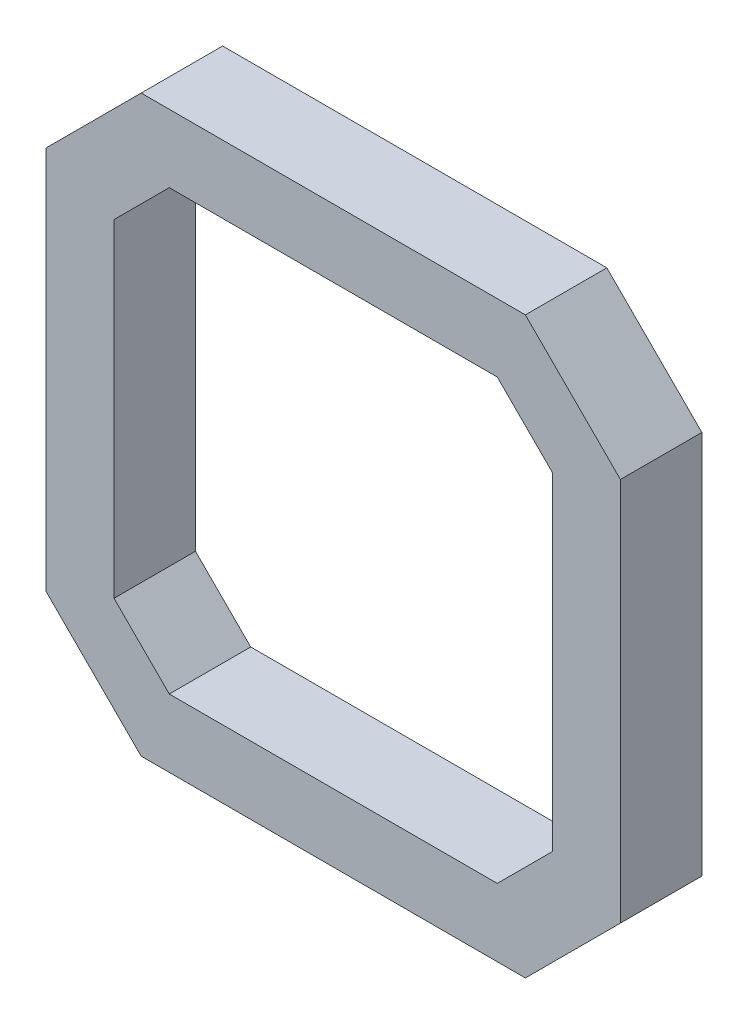
ISO-10303-21;
HEADER;
FILE_DESCRIPTION(('STEP AP214'),'2;1');
FILE_NAME('part.step','',(''),(''),'','','');
FILE_SCHEMA(('AUTOMOTIVE_DESIGN { 1 0 10303 214 1 1 1 1 }'));
ENDSEC;
DATA;
#1=APPLICATION_CONTEXT('core data for automotive mechanical design processes');
#2=APPLICATION_PROTOCOL_DEFINITION('international standard','automotive_design',2000,#1);
#3=PRODUCT_CONTEXT('',#1,'mechanical');
#4=PRODUCT('Part','Part','',(#3));
#5=PRODUCT_RELATED_PRODUCT_CATEGORY('part','',(#4));
#6=PRODUCT_DEFINITION_FORMATION('','',#4);
#7=PRODUCT_DEFINITION_CONTEXT('part definition',#1,'design');
#8=PRODUCT_DEFINITION('design','',#6,#7);
#9=PRODUCT_DEFINITION_SHAPE('','',#8);
#10=(LENGTH_UNIT() NAMED_UNIT(*) SI_UNIT(.MILLI.,.METRE.));
#11=(NAMED_UNIT(*) PLANE_ANGLE_UNIT() SI_UNIT($,.RADIAN.));
#12=(NAMED_UNIT(*) SI_UNIT($,.STERADIAN.) SOLID_ANGLE_UNIT());
#13=UNCERTAINTY_MEASURE_WITH_UNIT(LENGTH_MEASURE(1.E-05),#10,'distance_accuracy_value','');
#14=(GEOMETRIC_REPRESENTATION_CONTEXT(3) GLOBAL_UNCERTAINTY_ASSIGNED_CONTEXT((#13)) GLOBAL_UNIT_ASSIGNED_CONTEXT((#10,
#11,#12)) REPRESENTATION_CONTEXT('',''));
#15=CARTESIAN_POINT('',(0.,0.,0.));
#16=DIRECTION('',(0.,0.,1.));
#17=DIRECTION('',(1.,0.,0.));
#18=AXIS2_PLACEMENT_3D('',#15,#16,#17);
#19=CARTESIAN_POINT('',(0.,0.,6.));
#20=DIRECTION('',(0.,0.,-1.));
#21=DIRECTION('',(-1.,0.,0.));
#22=AXIS2_PLACEMENT_3D('',#19,#20,#21);
#23=PLANE('',#22);
#24=DIRECTION('',(0.,-1.,0.));
#25=VECTOR('',#24,1.);
#26=CARTESIAN_POINT('',(-21.15,-14.15,6.));
#27=LINE('',#26,#25);
#28=CARTESIAN_POINT('',(-21.15,14.15,6.));
#29=VERTEX_POINT('',#28);
#30=CARTESIAN_POINT('',(-21.15,-14.15,6.));
#31=VERTEX_POINT('',#30);
#32=EDGE_CURVE('E244',#29,#31,#27,.T.);
#33=ORIENTED_EDGE('',*,*,#32,.T.);
#34=DIRECTION('',(0.707106781186547,-0.707106781186547,0.));
#35=VECTOR('',#34,1.);
#36=CARTESIAN_POINT('',(-21.15,-14.15,6.));
#37=LINE('',#36,#35);
#38=CARTESIAN_POINT('',(-14.15,-21.15,6.));
#39=VERTEX_POINT('',#38);
#40=EDGE_CURVE('E248',#31,#39,#37,.T.);
#41=ORIENTED_EDGE('',*,*,#40,.T.);
#42=DIRECTION('',(1.,0.,0.));
#43=VECTOR('',#42,1.);
#44=CARTESIAN_POINT('',(-14.15,-21.15,6.));
#45=LINE('',#44,#43);
#46=CARTESIAN_POINT('',(14.15,-21.15,6.));
#47=VERTEX_POINT('',#46);
#48=EDGE_CURVE('E252',#39,#47,#45,.T.);
#49=ORIENTED_EDGE('',*,*,#48,.T.);
#50=DIRECTION('',(0.707106781186547,0.707106781186547,0.));
#51=VECTOR('',#50,1.);
#52=CARTESIAN_POINT('',(14.15,-21.15,6.));
#53=LINE('',#52,#51);
#54=CARTESIAN_POINT('',(21.15,-14.15,6.));
#55=VERTEX_POINT('',#54);
#56=EDGE_CURVE('E255',#47,#55,#53,.T.);
#57=ORIENTED_EDGE('',*,*,#56,.T.);
#58=DIRECTION('',(0.,1.,0.));
#59=VECTOR('',#58,1.);
#60=CARTESIAN_POINT('',(21.15,-14.15,6.));
#61=LINE('',#60,#59);
#62=CARTESIAN_POINT('',(21.15,14.15,6.));
#63=VERTEX_POINT('',#62);
#64=EDGE_CURVE('E258',#55,#63,#61,.T.);
#65=ORIENTED_EDGE('',*,*,#64,.T.);
#66=DIRECTION('',(-0.707106781186547,0.707106781186547,0.));
#67=VECTOR('',#66,1.);
#68=CARTESIAN_POINT('',(14.15,21.15,6.));
#69=LINE('',#68,#67);
#70=CARTESIAN_POINT('',(14.15,21.15,6.));
#71=VERTEX_POINT('',#70);
#72=EDGE_CURVE('E261',#63,#71,#69,.T.);
#73=ORIENTED_EDGE('',*,*,#72,.T.);
#74=DIRECTION('',(-1.,0.,0.));
#75=VECTOR('',#74,1.);
#76=CARTESIAN_POINT('',(-14.15,21.15,6.));
#77=LINE('',#76,#75);
#78=CARTESIAN_POINT('',(-14.15,21.15,6.));
#79=VERTEX_POINT('',#78);
#80=EDGE_CURVE('E264',#71,#79,#77,.T.);
#81=ORIENTED_EDGE('',*,*,#80,.T.);
#82=DIRECTION('',(-0.707106781186547,-0.707106781186547,0.));
#83=VECTOR('',#82,1.);
#84=CARTESIAN_POINT('',(-21.15,14.15,6.));
#85=LINE('',#84,#83);
#86=EDGE_CURVE('E267',#79,#29,#85,.T.);
#87=ORIENTED_EDGE('',*,*,#86,.T.);
#88=EDGE_LOOP('',(#33,#41,#49,#57,#65,#73,#81,#87));
#89=FACE_BOUND('',#88,.T.);
#90=DIRECTION('',(-0.707106781186547,-0.707106781186547,0.));
#91=VECTOR('',#90,1.);
#92=CARTESIAN_POINT('',(-16.15,12.0789321881345,6.));
#93=LINE('',#92,#91);
#94=CARTESIAN_POINT('',(-12.0789321881345,16.15,6.));
#95=VERTEX_POINT('',#94);
#96=CARTESIAN_POINT('',(-16.15,12.0789321881345,6.));
#97=VERTEX_POINT('',#96);
#98=EDGE_CURVE('E155',#95,#97,#93,.T.);
#99=ORIENTED_EDGE('',*,*,#98,.F.);
#100=DIRECTION('',(-1.,0.,0.));
#101=VECTOR('',#100,1.);
#102=CARTESIAN_POINT('',(-12.0789321881345,16.15,6.));
#103=LINE('',#102,#101);
#104=CARTESIAN_POINT('',(12.0789321881345,16.15,6.));
#105=VERTEX_POINT('',#104);
#106=EDGE_CURVE('E196',#105,#95,#103,.T.);
#107=ORIENTED_EDGE('',*,*,#106,.F.);
#108=DIRECTION('',(-0.707106781186547,0.707106781186547,0.));
#109=VECTOR('',#108,1.);
#110=CARTESIAN_POINT('',(12.0789321881345,16.15,6.));
#111=LINE('',#110,#109);
#112=CARTESIAN_POINT('',(16.15,12.0789321881345,6.));
#113=VERTEX_POINT('',#112);
#114=EDGE_CURVE('E193',#113,#105,#111,.T.);
#115=ORIENTED_EDGE('',*,*,#114,.F.);
#116=DIRECTION('',(0.,1.,0.));
#117=VECTOR('',#116,1.);
#118=CARTESIAN_POINT('',(16.15,-12.0789321881345,6.));
#119=LINE('',#118,#117);
#120=CARTESIAN_POINT('',(16.15,-12.0789321881345,6.));
#121=VERTEX_POINT('',#120);
#122=EDGE_CURVE('E190',#121,#113,#119,.T.);
#123=ORIENTED_EDGE('',*,*,#122,.F.);
#124=DIRECTION('',(0.707106781186547,0.707106781186547,0.));
#125=VECTOR('',#124,1.);
#126=CARTESIAN_POINT('',(12.0789321881345,-16.15,6.));
#127=LINE('',#126,#125);
#128=CARTESIAN_POINT('',(12.0789321881345,-16.15,6.));
#129=VERTEX_POINT('',#128);
#130=EDGE_CURVE('E187',#129,#121,#127,.T.);
#131=ORIENTED_EDGE('',*,*,#130,.F.);
#132=DIRECTION('',(1.,0.,0.));
#133=VECTOR('',#132,1.);
#134=CARTESIAN_POINT('',(-12.0789321881345,-16.15,6.));
#135=LINE('',#134,#133);
#136=CARTESIAN_POINT('',(-12.0789321881345,-16.15,6.));
#137=VERTEX_POINT('',#136);
#138=EDGE_CURVE('E182',#137,#129,#135,.T.);
#139=ORIENTED_EDGE('',*,*,#138,.F.);
#140=DIRECTION('',(0.707106781186547,-0.707106781186547,0.));
#141=VECTOR('',#140,1.);
#142=CARTESIAN_POINT('',(-16.15,-12.0789321881345,6.));
#143=LINE('',#142,#141);
#144=CARTESIAN_POINT('',(-16.15,-12.0789321881345,6.));
#145=VERTEX_POINT('',#144);
#146=EDGE_CURVE('E178',#145,#137,#143,.T.);
#147=ORIENTED_EDGE('',*,*,#146,.F.);
#148=DIRECTION('',(0.,-1.,0.));
#149=VECTOR('',#148,1.);
#150=CARTESIAN_POINT('',(-16.15,-12.0789321881345,6.));
#151=LINE('',#150,#149);
#152=EDGE_CURVE('E164',#97,#145,#151,.T.);
#153=ORIENTED_EDGE('',*,*,#152,.F.);
#154=EDGE_LOOP('',(#99,#107,#115,#123,#131,#139,#147,#153));
#155=FACE_BOUND('',#154,.T.);
#156=ADVANCED_FACE('F41',(#89,#155),#23,.F.);
#157=CARTESIAN_POINT('',(0.,0.,0.));
#158=DIRECTION('',(0.,0.,-1.));
#159=DIRECTION('',(-1.,0.,0.));
#160=AXIS2_PLACEMENT_3D('',#157,#158,#159);
#161=PLANE('',#160);
#162=DIRECTION('',(0.,-1.,0.));
#163=VECTOR('',#162,1.);
#164=CARTESIAN_POINT('',(-21.15,-14.15,0.));
#165=LINE('',#164,#163);
#166=CARTESIAN_POINT('',(-21.15,14.15,0.));
#167=VERTEX_POINT('',#166);
#168=CARTESIAN_POINT('',(-21.15,-14.15,0.));
#169=VERTEX_POINT('',#168);
#170=EDGE_CURVE('E173',#167,#169,#165,.T.);
#171=ORIENTED_EDGE('',*,*,#170,.F.);
#172=DIRECTION('',(-0.707106781186547,-0.707106781186547,0.));
#173=VECTOR('',#172,1.);
#174=CARTESIAN_POINT('',(-21.15,14.15,0.));
#175=LINE('',#174,#173);
#176=CARTESIAN_POINT('',(-14.15,21.15,0.));
#177=VERTEX_POINT('',#176);
#178=EDGE_CURVE('E249',#177,#167,#175,.T.);
#179=ORIENTED_EDGE('',*,*,#178,.F.);
#180=DIRECTION('',(-1.,0.,0.));
#181=VECTOR('',#180,1.);
#182=CARTESIAN_POINT('',(-14.15,21.15,0.));
#183=LINE('',#182,#181);
#184=CARTESIAN_POINT('',(14.15,21.15,0.));
#185=VERTEX_POINT('',#184);
#186=EDGE_CURVE('E289',#185,#177,#183,.T.);
#187=ORIENTED_EDGE('',*,*,#186,.F.);
#188=DIRECTION('',(-0.707106781186547,0.707106781186547,0.));
#189=VECTOR('',#188,1.);
#190=CARTESIAN_POINT('',(14.15,21.15,0.));
#191=LINE('',#190,#189);
#192=CARTESIAN_POINT('',(21.15,14.15,0.));
#193=VERTEX_POINT('',#192);
#194=EDGE_CURVE('E286',#193,#185,#191,.T.);
#195=ORIENTED_EDGE('',*,*,#194,.F.);
#196=DIRECTION('',(0.,1.,0.));
#197=VECTOR('',#196,1.);
#198=CARTESIAN_POINT('',(21.15,-14.15,0.));
#199=LINE('',#198,#197);
#200=CARTESIAN_POINT('',(21.15,-14.15,0.));
#201=VERTEX_POINT('',#200);
#202=EDGE_CURVE('E283',#201,#193,#199,.T.);
#203=ORIENTED_EDGE('',*,*,#202,.F.);
#204=DIRECTION('',(0.707106781186547,0.707106781186547,0.));
#205=VECTOR('',#204,1.);
#206=CARTESIAN_POINT('',(14.15,-21.15,0.));
#207=LINE('',#206,#205);
#208=CARTESIAN_POINT('',(14.15,-21.15,0.));
#209=VERTEX_POINT('',#208);
#210=EDGE_CURVE('E280',#209,#201,#207,.T.);
#211=ORIENTED_EDGE('',*,*,#210,.F.);
#212=DIRECTION('',(1.,0.,0.));
#213=VECTOR('',#212,1.);
#214=CARTESIAN_POINT('',(-14.15,-21.15,0.));
#215=LINE('',#214,#213);
#216=CARTESIAN_POINT('',(-14.15,-21.15,0.));
#217=VERTEX_POINT('',#216);
#218=EDGE_CURVE('E277',#217,#209,#215,.T.);
#219=ORIENTED_EDGE('',*,*,#218,.F.);
#220=DIRECTION('',(0.707106781186547,-0.707106781186547,0.));
#221=VECTOR('',#220,1.);
#222=CARTESIAN_POINT('',(-21.15,-14.15,0.));
#223=LINE('',#222,#221);
#224=EDGE_CURVE('E274',#169,#217,#223,.T.);
#225=ORIENTED_EDGE('',*,*,#224,.F.);
#226=EDGE_LOOP('',(#171,#179,#187,#195,#203,#211,#219,#225));
#227=FACE_BOUND('',#226,.T.);
#228=DIRECTION('',(-1.,0.,0.));
#229=VECTOR('',#228,1.);
#230=CARTESIAN_POINT('',(-12.0789321881345,16.15,0.));
#231=LINE('',#230,#229);
#232=CARTESIAN_POINT('',(12.0789321881345,16.15,0.));
#233=VERTEX_POINT('',#232);
#234=CARTESIAN_POINT('',(-12.0789321881345,16.15,0.));
#235=VERTEX_POINT('',#234);
#236=EDGE_CURVE('E165',#233,#235,#231,.T.);
#237=ORIENTED_EDGE('',*,*,#236,.T.);
#238=DIRECTION('',(-0.707106781186547,-0.707106781186547,0.));
#239=VECTOR('',#238,1.);
#240=CARTESIAN_POINT('',(-16.15,12.0789321881345,0.));
#241=LINE('',#240,#239);
#242=CARTESIAN_POINT('',(-16.15,12.0789321881345,0.));
#243=VERTEX_POINT('',#242);
#244=EDGE_CURVE('E65',#235,#243,#241,.T.);
#245=ORIENTED_EDGE('',*,*,#244,.T.);
#246=DIRECTION('',(0.,-1.,0.));
#247=VECTOR('',#246,1.);
#248=CARTESIAN_POINT('',(-16.15,-12.0789321881345,0.));
#249=LINE('',#248,#247);
#250=CARTESIAN_POINT('',(-16.15,-12.0789321881345,0.));
#251=VERTEX_POINT('',#250);
#252=EDGE_CURVE('E171',#243,#251,#249,.T.);
#253=ORIENTED_EDGE('',*,*,#252,.T.);
#254=DIRECTION('',(0.707106781186547,-0.707106781186547,0.));
#255=VECTOR('',#254,1.);
#256=CARTESIAN_POINT('',(-16.15,-12.0789321881345,0.));
#257=LINE('',#256,#255);
#258=CARTESIAN_POINT('',(-12.0789321881345,-16.15,0.));
#259=VERTEX_POINT('',#258);
#260=EDGE_CURVE('E203',#251,#259,#257,.T.);
#261=ORIENTED_EDGE('',*,*,#260,.T.);
#262=DIRECTION('',(1.,0.,0.));
#263=VECTOR('',#262,1.);
#264=CARTESIAN_POINT('',(-12.0789321881345,-16.15,0.));
#265=LINE('',#264,#263);
#266=CARTESIAN_POINT('',(12.0789321881345,-16.15,0.));
#267=VERTEX_POINT('',#266);
#268=EDGE_CURVE('E207',#259,#267,#265,.T.);
#269=ORIENTED_EDGE('',*,*,#268,.T.);
#270=DIRECTION('',(0.707106781186547,0.707106781186547,0.));
#271=VECTOR('',#270,1.);
#272=CARTESIAN_POINT('',(12.0789321881345,-16.15,0.));
#273=LINE('',#272,#271);
#274=CARTESIAN_POINT('',(16.15,-12.0789321881345,0.));
#275=VERTEX_POINT('',#274);
#276=EDGE_CURVE('E211',#267,#275,#273,.T.);
#277=ORIENTED_EDGE('',*,*,#276,.T.);
#278=DIRECTION('',(0.,1.,0.));
#279=VECTOR('',#278,1.);
#280=CARTESIAN_POINT('',(16.15,-12.0789321881345,0.));
#281=LINE('',#280,#279);
#282=CARTESIAN_POINT('',(16.15,12.0789321881345,0.));
#283=VERTEX_POINT('',#282);
#284=EDGE_CURVE('E215',#275,#283,#281,.T.);
#285=ORIENTED_EDGE('',*,*,#284,.T.);
#286=DIRECTION('',(-0.707106781186547,0.707106781186547,0.));
#287=VECTOR('',#286,1.);
#288=CARTESIAN_POINT('',(12.0789321881345,16.15,0.));
#289=LINE('',#288,#287);
#290=EDGE_CURVE('E219',#283,#233,#289,.T.);
#291=ORIENTED_EDGE('',*,*,#290,.T.);
#292=EDGE_LOOP('',(#237,#245,#253,#261,#269,#277,#285,#291));
#293=FACE_BOUND('',#292,.T.);
#294=ADVANCED_FACE('F328',(#227,#293),#161,.T.);
#295=CARTESIAN_POINT('',(-21.15,-14.15,6.));
#296=DIRECTION('',(1.,0.,0.));
#297=DIRECTION('',(0.,0.,-1.));
#298=AXIS2_PLACEMENT_3D('',#295,#296,#297);
#299=PLANE('',#298);
#300=ORIENTED_EDGE('',*,*,#170,.T.);
#301=DIRECTION('',(0.,0.,-1.));
#302=VECTOR('',#301,1.);
#303=CARTESIAN_POINT('',(-21.15,-14.15,6.));
#304=LINE('',#303,#302);
#305=EDGE_CURVE('E11',#31,#169,#304,.T.);
#306=ORIENTED_EDGE('',*,*,#305,.F.);
#307=ORIENTED_EDGE('',*,*,#32,.F.);
#308=DIRECTION('',(0.,0.,-1.));
#309=VECTOR('',#308,1.);
#310=CARTESIAN_POINT('',(-21.15,14.15,6.));
#311=LINE('',#310,#309);
#312=EDGE_CURVE('E270',#29,#167,#311,.T.);
#313=ORIENTED_EDGE('',*,*,#312,.T.);
#314=EDGE_LOOP('',(#300,#306,#307,#313));
#315=FACE_BOUND('',#314,.T.);
#316=ADVANCED_FACE('F43',(#315),#299,.F.);
#317=CARTESIAN_POINT('',(-21.15,-14.15,6.));
#318=DIRECTION('',(0.707106781186548,0.707106781186548,0.));
#319=DIRECTION('',(-0.707106781186548,0.707106781186548,0.));
#320=AXIS2_PLACEMENT_3D('',#317,#318,#319);
#321=PLANE('',#320);
#322=ORIENTED_EDGE('',*,*,#224,.T.);
#323=DIRECTION('',(0.,0.,-1.));
#324=VECTOR('',#323,1.);
#325=CARTESIAN_POINT('',(-14.15,-21.15,6.));
#326=LINE('',#325,#324);
#327=EDGE_CURVE('E50',#39,#217,#326,.T.);
#328=ORIENTED_EDGE('',*,*,#327,.F.);
#329=ORIENTED_EDGE('',*,*,#40,.F.);
#330=ORIENTED_EDGE('',*,*,#305,.T.);
#331=EDGE_LOOP('',(#322,#328,#329,#330));
#332=FACE_BOUND('',#331,.T.);
#333=ADVANCED_FACE('F345',(#332),#321,.F.);
#334=CARTESIAN_POINT('',(-14.15,-21.15,6.));
#335=DIRECTION('',(0.,1.,0.));
#336=DIRECTION('',(0.,0.,1.));
#337=AXIS2_PLACEMENT_3D('',#334,#335,#336);
#338=PLANE('',#337);
#339=ORIENTED_EDGE('',*,*,#218,.T.);
#340=DIRECTION('',(0.,0.,-1.));
#341=VECTOR('',#340,1.);
#342=CARTESIAN_POINT('',(14.15,-21.15,6.));
#343=LINE('',#342,#341);
#344=EDGE_CURVE('E313',#47,#209,#343,.T.);
#345=ORIENTED_EDGE('',*,*,#344,.F.);
#346=ORIENTED_EDGE('',*,*,#48,.F.);
#347=ORIENTED_EDGE('',*,*,#327,.T.);
#348=EDGE_LOOP('',(#339,#345,#346,#347));
#349=FACE_BOUND('',#348,.T.);
#350=ADVANCED_FACE('F322',(#349),#338,.F.);
#351=CARTESIAN_POINT('',(14.15,-21.15,6.));
#352=DIRECTION('',(-0.707106781186548,0.707106781186548,0.));
#353=DIRECTION('',(-0.707106781186548,-0.707106781186548,0.));
#354=AXIS2_PLACEMENT_3D('',#351,#352,#353);
#355=PLANE('',#354);
#356=ORIENTED_EDGE('',*,*,#210,.T.);
#357=DIRECTION('',(0.,0.,-1.));
#358=VECTOR('',#357,1.);
#359=CARTESIAN_POINT('',(21.15,-14.15,6.));
#360=LINE('',#359,#358);
#361=EDGE_CURVE('E309',#55,#201,#360,.T.);
#362=ORIENTED_EDGE('',*,*,#361,.F.);
#363=ORIENTED_EDGE('',*,*,#56,.F.);
#364=ORIENTED_EDGE('',*,*,#344,.T.);
#365=EDGE_LOOP('',(#356,#362,#363,#364));
#366=FACE_BOUND('',#365,.T.);
#367=ADVANCED_FACE('F334',(#366),#355,.F.);
#368=CARTESIAN_POINT('',(21.15,-14.15,6.));
#369=DIRECTION('',(-1.,0.,0.));
#370=DIRECTION('',(0.,0.,1.));
#371=AXIS2_PLACEMENT_3D('',#368,#369,#370);
#372=PLANE('',#371);
#373=ORIENTED_EDGE('',*,*,#202,.T.);
#374=DIRECTION('',(0.,0.,-1.));
#375=VECTOR('',#374,1.);
#376=CARTESIAN_POINT('',(21.15,14.15,6.));
#377=LINE('',#376,#375);
#378=EDGE_CURVE('E305',#63,#193,#377,.T.);
#379=ORIENTED_EDGE('',*,*,#378,.F.);
#380=ORIENTED_EDGE('',*,*,#64,.F.);
#381=ORIENTED_EDGE('',*,*,#361,.T.);
#382=EDGE_LOOP('',(#373,#379,#380,#381));
#383=FACE_BOUND('',#382,.T.);
#384=ADVANCED_FACE('F338',(#383),#372,.F.);
#385=CARTESIAN_POINT('',(14.15,21.15,6.));
#386=DIRECTION('',(-0.707106781186548,-0.707106781186548,0.));
#387=DIRECTION('',(0.707106781186548,-0.707106781186548,0.));
#388=AXIS2_PLACEMENT_3D('',#385,#386,#387);
#389=PLANE('',#388);
#390=ORIENTED_EDGE('',*,*,#194,.T.);
#391=DIRECTION('',(0.,0.,-1.));
#392=VECTOR('',#391,1.);
#393=CARTESIAN_POINT('',(14.15,21.15,6.));
#394=LINE('',#393,#392);
#395=EDGE_CURVE('E301',#71,#185,#394,.T.);
#396=ORIENTED_EDGE('',*,*,#395,.F.);
#397=ORIENTED_EDGE('',*,*,#72,.F.);
#398=ORIENTED_EDGE('',*,*,#378,.T.);
#399=EDGE_LOOP('',(#390,#396,#397,#398));
#400=FACE_BOUND('',#399,.T.);
#401=ADVANCED_FACE('F358',(#400),#389,.F.);
#402=CARTESIAN_POINT('',(-14.15,21.15,6.));
#403=DIRECTION('',(0.,-1.,0.));
#404=DIRECTION('',(0.,0.,-1.));
#405=AXIS2_PLACEMENT_3D('',#402,#403,#404);
#406=PLANE('',#405);
#407=ORIENTED_EDGE('',*,*,#186,.T.);
#408=DIRECTION('',(0.,0.,-1.));
#409=VECTOR('',#408,1.);
#410=CARTESIAN_POINT('',(-14.15,21.15,6.));
#411=LINE('',#410,#409);
#412=EDGE_CURVE('E297',#79,#177,#411,.T.);
#413=ORIENTED_EDGE('',*,*,#412,.F.);
#414=ORIENTED_EDGE('',*,*,#80,.F.);
#415=ORIENTED_EDGE('',*,*,#395,.T.);
#416=EDGE_LOOP('',(#407,#413,#414,#415));
#417=FACE_BOUND('',#416,.T.);
#418=ADVANCED_FACE('F356',(#417),#406,.F.);
#419=CARTESIAN_POINT('',(-21.15,14.15,6.));
#420=DIRECTION('',(0.707106781186548,-0.707106781186548,0.));
#421=DIRECTION('',(0.707106781186548,0.707106781186548,0.));
#422=AXIS2_PLACEMENT_3D('',#419,#420,#421);
#423=PLANE('',#422);
#424=ORIENTED_EDGE('',*,*,#178,.T.);
#425=ORIENTED_EDGE('',*,*,#312,.F.);
#426=ORIENTED_EDGE('',*,*,#86,.F.);
#427=ORIENTED_EDGE('',*,*,#412,.T.);
#428=EDGE_LOOP('',(#424,#425,#426,#427));
#429=FACE_BOUND('',#428,.T.);
#430=ADVANCED_FACE('F351',(#429),#423,.F.);
#431=CARTESIAN_POINT('',(-16.15,12.0789321881345,6.));
#432=DIRECTION('',(0.707106781186548,-0.707106781186548,0.));
#433=DIRECTION('',(0.707106781186548,0.707106781186548,0.));
#434=AXIS2_PLACEMENT_3D('',#431,#432,#433);
#435=PLANE('',#434);
#436=ORIENTED_EDGE('',*,*,#244,.F.);
#437=DIRECTION('',(0.,0.,-1.));
#438=VECTOR('',#437,1.);
#439=CARTESIAN_POINT('',(-12.0789321881345,16.15,6.));
#440=LINE('',#439,#438);
#441=EDGE_CURVE('E159',#95,#235,#440,.T.);
#442=ORIENTED_EDGE('',*,*,#441,.F.);
#443=ORIENTED_EDGE('',*,*,#98,.T.);
#444=DIRECTION('',(0.,0.,-1.));
#445=VECTOR('',#444,1.);
#446=CARTESIAN_POINT('',(-16.15,12.0789321881345,6.));
#447=LINE('',#446,#445);
#448=EDGE_CURVE('E158',#97,#243,#447,.T.);
#449=ORIENTED_EDGE('',*,*,#448,.T.);
#450=EDGE_LOOP('',(#436,#442,#443,#449));
#451=FACE_BOUND('',#450,.T.);
#452=ADVANCED_FACE('F157',(#451),#435,.T.);
#453=CARTESIAN_POINT('',(-16.15,-12.0789321881345,6.));
#454=DIRECTION('',(1.,0.,0.));
#455=DIRECTION('',(0.,0.,-1.));
#456=AXIS2_PLACEMENT_3D('',#453,#454,#455);
#457=PLANE('',#456);
#458=ORIENTED_EDGE('',*,*,#252,.F.);
#459=ORIENTED_EDGE('',*,*,#448,.F.);
#460=ORIENTED_EDGE('',*,*,#152,.T.);
#461=DIRECTION('',(0.,0.,-1.));
#462=VECTOR('',#461,1.);
#463=CARTESIAN_POINT('',(-16.15,-12.0789321881345,6.));
#464=LINE('',#463,#462);
#465=EDGE_CURVE('E174',#145,#251,#464,.T.);
#466=ORIENTED_EDGE('',*,*,#465,.T.);
#467=EDGE_LOOP('',(#458,#459,#460,#466));
#468=FACE_BOUND('',#467,.T.);
#469=ADVANCED_FACE('F168',(#468),#457,.T.);
#470=CARTESIAN_POINT('',(-16.15,-12.0789321881345,6.));
#471=DIRECTION('',(0.707106781186548,0.707106781186548,0.));
#472=DIRECTION('',(-0.707106781186548,0.707106781186548,0.));
#473=AXIS2_PLACEMENT_3D('',#470,#471,#472);
#474=PLANE('',#473);
#475=ORIENTED_EDGE('',*,*,#260,.F.);
#476=ORIENTED_EDGE('',*,*,#465,.F.);
#477=ORIENTED_EDGE('',*,*,#146,.T.);
#478=DIRECTION('',(0.,0.,-1.));
#479=VECTOR('',#478,1.);
#480=CARTESIAN_POINT('',(-12.0789321881345,-16.15,6.));
#481=LINE('',#480,#479);
#482=EDGE_CURVE('E239',#137,#259,#481,.T.);
#483=ORIENTED_EDGE('',*,*,#482,.T.);
#484=EDGE_LOOP('',(#475,#476,#477,#483));
#485=FACE_BOUND('',#484,.T.);
#486=ADVANCED_FACE('F383',(#485),#474,.T.);
#487=CARTESIAN_POINT('',(-12.0789321881345,-16.15,6.));
#488=DIRECTION('',(0.,1.,0.));
#489=DIRECTION('',(0.,0.,1.));
#490=AXIS2_PLACEMENT_3D('',#487,#488,#489);
#491=PLANE('',#490);
#492=ORIENTED_EDGE('',*,*,#268,.F.);
#493=ORIENTED_EDGE('',*,*,#482,.F.);
#494=ORIENTED_EDGE('',*,*,#138,.T.);
#495=DIRECTION('',(0.,0.,-1.));
#496=VECTOR('',#495,1.);
#497=CARTESIAN_POINT('',(12.0789321881345,-16.15,6.));
#498=LINE('',#497,#496);
#499=EDGE_CURVE('E236',#129,#267,#498,.T.);
#500=ORIENTED_EDGE('',*,*,#499,.T.);
#501=EDGE_LOOP('',(#492,#493,#494,#500));
#502=FACE_BOUND('',#501,.T.);
#503=ADVANCED_FACE('F387',(#502),#491,.T.);
#504=CARTESIAN_POINT('',(12.0789321881345,-16.15,6.));
#505=DIRECTION('',(-0.707106781186548,0.707106781186548,0.));
#506=DIRECTION('',(-0.707106781186548,-0.707106781186548,0.));
#507=AXIS2_PLACEMENT_3D('',#504,#505,#506);
#508=PLANE('',#507);
#509=ORIENTED_EDGE('',*,*,#276,.F.);
#510=ORIENTED_EDGE('',*,*,#499,.F.);
#511=ORIENTED_EDGE('',*,*,#130,.T.);
#512=DIRECTION('',(0.,0.,-1.));
#513=VECTOR('',#512,1.);
#514=CARTESIAN_POINT('',(16.15,-12.0789321881345,6.));
#515=LINE('',#514,#513);
#516=EDGE_CURVE('E233',#121,#275,#515,.T.);
#517=ORIENTED_EDGE('',*,*,#516,.T.);
#518=EDGE_LOOP('',(#509,#510,#511,#517));
#519=FACE_BOUND('',#518,.T.);
#520=ADVANCED_FACE('F393',(#519),#508,.T.);
#521=CARTESIAN_POINT('',(16.15,-12.0789321881345,6.));
#522=DIRECTION('',(-1.,0.,0.));
#523=DIRECTION('',(0.,0.,1.));
#524=AXIS2_PLACEMENT_3D('',#521,#522,#523);
#525=PLANE('',#524);
#526=ORIENTED_EDGE('',*,*,#284,.F.);
#527=ORIENTED_EDGE('',*,*,#516,.F.);
#528=ORIENTED_EDGE('',*,*,#122,.T.);
#529=DIRECTION('',(0.,0.,-1.));
#530=VECTOR('',#529,1.);
#531=CARTESIAN_POINT('',(16.15,12.0789321881345,6.));
#532=LINE('',#531,#530);
#533=EDGE_CURVE('E230',#113,#283,#532,.T.);
#534=ORIENTED_EDGE('',*,*,#533,.T.);
#535=EDGE_LOOP('',(#526,#527,#528,#534));
#536=FACE_BOUND('',#535,.T.);
#537=ADVANCED_FACE('F397',(#536),#525,.T.);
#538=CARTESIAN_POINT('',(12.0789321881345,16.15,6.));
#539=DIRECTION('',(-0.707106781186548,-0.707106781186548,0.));
#540=DIRECTION('',(0.707106781186548,-0.707106781186548,0.));
#541=AXIS2_PLACEMENT_3D('',#538,#539,#540);
#542=PLANE('',#541);
#543=ORIENTED_EDGE('',*,*,#290,.F.);
#544=ORIENTED_EDGE('',*,*,#533,.F.);
#545=ORIENTED_EDGE('',*,*,#114,.T.);
#546=DIRECTION('',(0.,0.,-1.));
#547=VECTOR('',#546,1.);
#548=CARTESIAN_POINT('',(12.0789321881345,16.15,6.));
#549=LINE('',#548,#547);
#550=EDGE_CURVE('E57',#105,#233,#549,.T.);
#551=ORIENTED_EDGE('',*,*,#550,.T.);
#552=EDGE_LOOP('',(#543,#544,#545,#551));
#553=FACE_BOUND('',#552,.T.);
#554=ADVANCED_FACE('F401',(#553),#542,.T.);
#555=CARTESIAN_POINT('',(-12.0789321881345,16.15,6.));
#556=DIRECTION('',(0.,-1.,0.));
#557=DIRECTION('',(0.,0.,-1.));
#558=AXIS2_PLACEMENT_3D('',#555,#556,#557);
#559=PLANE('',#558);
#560=ORIENTED_EDGE('',*,*,#236,.F.);
#561=ORIENTED_EDGE('',*,*,#550,.F.);
#562=ORIENTED_EDGE('',*,*,#106,.T.);
#563=ORIENTED_EDGE('',*,*,#441,.T.);
#564=EDGE_LOOP('',(#560,#561,#562,#563));
#565=FACE_BOUND('',#564,.T.);
#566=ADVANCED_FACE('F405',(#565),#559,.T.);
#567=CLOSED_SHELL('',(#156,#294,#316,#333,#350,#367,#384,#401,#418,#430,#452,#469,#486,#503,
#520,#537,#554,#566));
#568=MANIFOLD_SOLID_BREP('B2',#567);
#569=ADVANCED_BREP_SHAPE_REPRESENTATION('',(#18,#568),#14);
#570=SHAPE_DEFINITION_REPRESENTATION(#9,#569);
ENDSEC;
END-ISO-10303-21;
